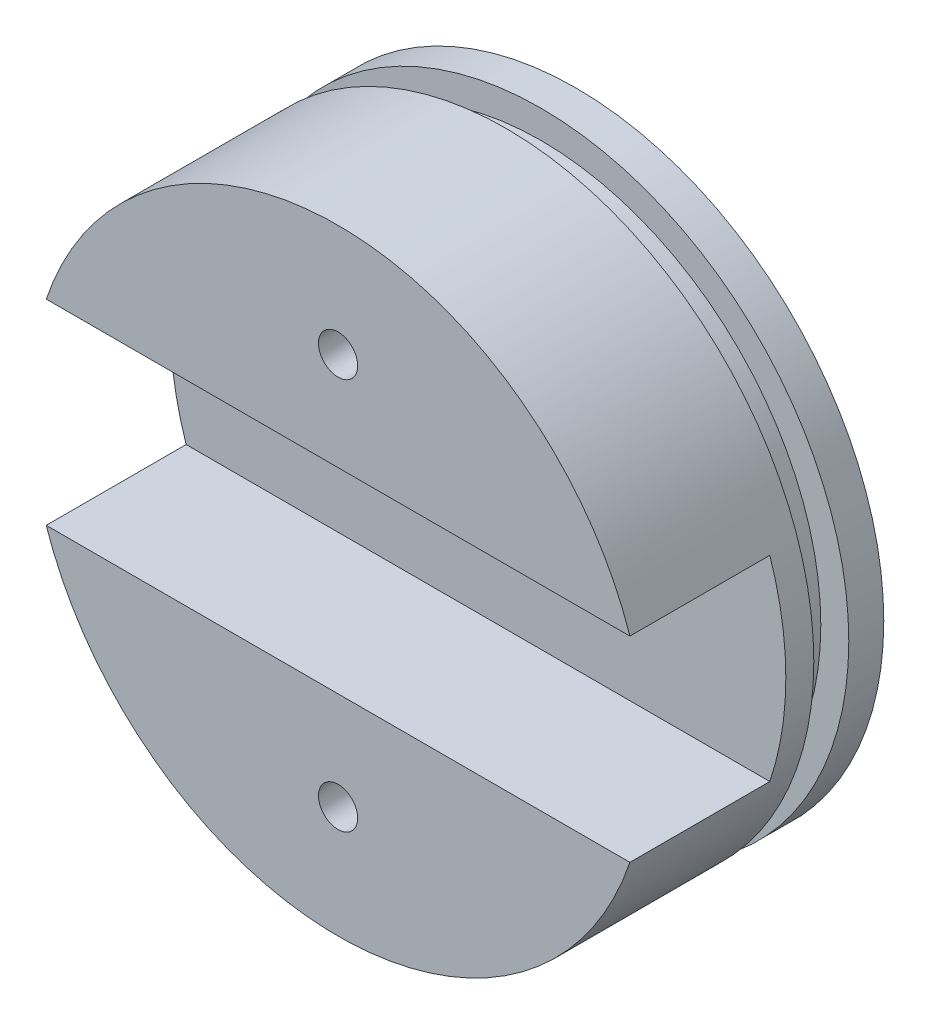
ISO-10303-21;
HEADER;
FILE_DESCRIPTION(('STEP AP214'),'2;1');
FILE_NAME('part.step','',(''),(''),'','','');
FILE_SCHEMA(('AUTOMOTIVE_DESIGN { 1 0 10303 214 1 1 1 1 }'));
ENDSEC;
DATA;
#1=APPLICATION_CONTEXT('core data for automotive mechanical design processes');
#2=APPLICATION_PROTOCOL_DEFINITION('international standard','automotive_design',2000,#1);
#3=PRODUCT_CONTEXT('',#1,'mechanical');
#4=PRODUCT('Part','Part','',(#3));
#5=PRODUCT_RELATED_PRODUCT_CATEGORY('part','',(#4));
#6=PRODUCT_DEFINITION_FORMATION('','',#4);
#7=PRODUCT_DEFINITION_CONTEXT('part definition',#1,'design');
#8=PRODUCT_DEFINITION('design','',#6,#7);
#9=PRODUCT_DEFINITION_SHAPE('','',#8);
#10=(LENGTH_UNIT() NAMED_UNIT(*) SI_UNIT(.MILLI.,.METRE.));
#11=(NAMED_UNIT(*) PLANE_ANGLE_UNIT() SI_UNIT($,.RADIAN.));
#12=(NAMED_UNIT(*) SI_UNIT($,.STERADIAN.) SOLID_ANGLE_UNIT());
#13=UNCERTAINTY_MEASURE_WITH_UNIT(LENGTH_MEASURE(1.E-05),#10,'distance_accuracy_value','');
#14=(GEOMETRIC_REPRESENTATION_CONTEXT(3) GLOBAL_UNCERTAINTY_ASSIGNED_CONTEXT((#13)) GLOBAL_UNIT_ASSIGNED_CONTEXT((#10,
#11,#12)) REPRESENTATION_CONTEXT('',''));
#15=CARTESIAN_POINT('',(0.,0.,0.));
#16=DIRECTION('',(0.,0.,1.));
#17=DIRECTION('',(1.,0.,0.));
#18=AXIS2_PLACEMENT_3D('',#15,#16,#17);
#19=CARTESIAN_POINT('',(0.,0.,17.));
#20=DIRECTION('',(0.,0.,-1.));
#21=DIRECTION('',(-1.,0.,0.));
#22=AXIS2_PLACEMENT_3D('',#19,#20,#21);
#23=CYLINDRICAL_SURFACE('',#22,22.);
#24=CARTESIAN_POINT('',(0.,0.,5.));
#25=DIRECTION('',(0.,0.,1.));
#26=DIRECTION('',(1.,0.,0.));
#27=AXIS2_PLACEMENT_3D('',#24,#25,#26);
#28=CIRCLE('',#27,22.);
#29=CARTESIAN_POINT('',(22.,0.,5.));
#30=VERTEX_POINT('',#29);
#31=EDGE_CURVE('E104',#30,#30,#28,.T.);
#32=ORIENTED_EDGE('',*,*,#31,.T.);
#33=EDGE_LOOP('',(#32));
#34=FACE_BOUND('',#33,.T.);
#35=DIRECTION('',(0.,0.,-1.));
#36=VECTOR('',#35,1.);
#37=CARTESIAN_POINT('',(20.8566536146142,-7.,17.));
#38=LINE('',#37,#36);
#39=CARTESIAN_POINT('',(20.8566536146142,-7.,17.));
#40=VERTEX_POINT('',#39);
#41=CARTESIAN_POINT('',(20.8566536146142,-7.,7.));
#42=VERTEX_POINT('',#41);
#43=EDGE_CURVE('E107',#40,#42,#38,.T.);
#44=ORIENTED_EDGE('',*,*,#43,.F.);
#45=CARTESIAN_POINT('',(0.,0.,17.));
#46=DIRECTION('',(0.,0.,1.));
#47=DIRECTION('',(1.,0.,0.));
#48=AXIS2_PLACEMENT_3D('',#45,#46,#47);
#49=CIRCLE('',#48,22.);
#50=CARTESIAN_POINT('',(-20.8566536146142,-7.,17.));
#51=VERTEX_POINT('',#50);
#52=EDGE_CURVE('E98',#51,#40,#49,.T.);
#53=ORIENTED_EDGE('',*,*,#52,.F.);
#54=DIRECTION('',(0.,0.,-1.));
#55=VECTOR('',#54,1.);
#56=CARTESIAN_POINT('',(-20.8566536146142,-7.,17.));
#57=LINE('',#56,#55);
#58=CARTESIAN_POINT('',(-20.8566536146142,-7.,7.));
#59=VERTEX_POINT('',#58);
#60=EDGE_CURVE('E94',#59,#51,#57,.F.);
#61=ORIENTED_EDGE('',*,*,#60,.F.);
#62=CARTESIAN_POINT('',(0.,0.,7.));
#63=DIRECTION('',(0.,0.,-1.));
#64=DIRECTION('',(-1.,0.,0.));
#65=AXIS2_PLACEMENT_3D('',#62,#63,#64);
#66=CIRCLE('',#65,22.);
#67=CARTESIAN_POINT('',(-20.8566536146142,7.,7.));
#68=VERTEX_POINT('',#67);
#69=EDGE_CURVE('E47',#59,#68,#66,.T.);
#70=ORIENTED_EDGE('',*,*,#69,.T.);
#71=DIRECTION('',(0.,0.,-1.));
#72=VECTOR('',#71,1.);
#73=CARTESIAN_POINT('',(-20.8566536146142,7.,17.));
#74=LINE('',#73,#72);
#75=CARTESIAN_POINT('',(-20.8566536146142,7.,17.));
#76=VERTEX_POINT('',#75);
#77=EDGE_CURVE('E83',#76,#68,#74,.T.);
#78=ORIENTED_EDGE('',*,*,#77,.F.);
#79=CARTESIAN_POINT('',(20.8566536146142,7.,17.));
#80=VERTEX_POINT('',#79);
#81=EDGE_CURVE('E92',#80,#76,#49,.T.);
#82=ORIENTED_EDGE('',*,*,#81,.F.);
#83=DIRECTION('',(0.,0.,-1.));
#84=VECTOR('',#83,1.);
#85=CARTESIAN_POINT('',(20.8566536146142,7.,17.));
#86=LINE('',#85,#84);
#87=CARTESIAN_POINT('',(20.8566536146142,7.,7.));
#88=VERTEX_POINT('',#87);
#89=EDGE_CURVE('E55',#88,#80,#86,.F.);
#90=ORIENTED_EDGE('',*,*,#89,.F.);
#91=EDGE_CURVE('E11',#88,#42,#66,.T.);
#92=ORIENTED_EDGE('',*,*,#91,.T.);
#93=EDGE_LOOP('',(#44,#53,#61,#70,#78,#82,#90,#92));
#94=FACE_BOUND('',#93,.T.);
#95=ADVANCED_FACE('F38',(#34,#94),#23,.T.);
#96=CARTESIAN_POINT('',(0.,0.,17.));
#97=DIRECTION('',(0.,0.,1.));
#98=DIRECTION('',(1.,0.,0.));
#99=AXIS2_PLACEMENT_3D('',#96,#97,#98);
#100=PLANE('',#99);
#101=CARTESIAN_POINT('',(0.,-14.,17.));
#102=DIRECTION('',(0.,0.,1.));
#103=DIRECTION('',(-1.,0.,0.));
#104=AXIS2_PLACEMENT_3D('',#101,#102,#103);
#105=CIRCLE('',#104,1.4);
#106=CARTESIAN_POINT('',(-1.4,-14.,17.));
#107=VERTEX_POINT('',#106);
#108=EDGE_CURVE('E125',#107,#107,#105,.T.);
#109=ORIENTED_EDGE('',*,*,#108,.F.);
#110=EDGE_LOOP('',(#109));
#111=FACE_BOUND('',#110,.T.);
#112=ORIENTED_EDGE('',*,*,#52,.T.);
#113=DIRECTION('',(-1.,0.,0.));
#114=VECTOR('',#113,1.);
#115=CARTESIAN_POINT('',(0.,-7.,17.));
#116=LINE('',#115,#114);
#117=EDGE_CURVE('E87',#40,#51,#116,.T.);
#118=ORIENTED_EDGE('',*,*,#117,.T.);
#119=EDGE_LOOP('',(#112,#118));
#120=FACE_BOUND('',#119,.T.);
#121=ADVANCED_FACE('F167',(#111,#120),#100,.T.);
#122=CARTESIAN_POINT('',(0.,14.,17.));
#123=DIRECTION('',(0.,0.,1.));
#124=DIRECTION('',(1.,0.,0.));
#125=AXIS2_PLACEMENT_3D('',#122,#123,#124);
#126=CIRCLE('',#125,1.4);
#127=CARTESIAN_POINT('',(1.4,14.,17.));
#128=VERTEX_POINT('',#127);
#129=EDGE_CURVE('E140',#128,#128,#126,.T.);
#130=ORIENTED_EDGE('',*,*,#129,.F.);
#131=EDGE_LOOP('',(#130));
#132=FACE_BOUND('',#131,.T.);
#133=ORIENTED_EDGE('',*,*,#81,.T.);
#134=DIRECTION('',(1.,0.,0.));
#135=VECTOR('',#134,1.);
#136=CARTESIAN_POINT('',(0.,7.,17.));
#137=LINE('',#136,#135);
#138=EDGE_CURVE('E80',#76,#80,#137,.T.);
#139=ORIENTED_EDGE('',*,*,#138,.T.);
#140=EDGE_LOOP('',(#133,#139));
#141=FACE_BOUND('',#140,.T.);
#142=ADVANCED_FACE('F96',(#132,#141),#100,.T.);
#143=CARTESIAN_POINT('',(0.,0.,2.5));
#144=DIRECTION('',(0.,0.,-1.));
#145=DIRECTION('',(-1.,0.,0.));
#146=AXIS2_PLACEMENT_3D('',#143,#144,#145);
#147=CYLINDRICAL_SURFACE('',#146,22.);
#148=CARTESIAN_POINT('',(0.,0.,2.5));
#149=DIRECTION('',(0.,0.,1.));
#150=DIRECTION('',(1.,0.,0.));
#151=AXIS2_PLACEMENT_3D('',#148,#149,#150);
#152=CIRCLE('',#151,22.);
#153=CARTESIAN_POINT('',(22.,0.,2.5));
#154=VERTEX_POINT('',#153);
#155=EDGE_CURVE('E88',#154,#154,#152,.T.);
#156=ORIENTED_EDGE('',*,*,#155,.F.);
#157=EDGE_LOOP('',(#156));
#158=FACE_BOUND('',#157,.T.);
#159=CARTESIAN_POINT('',(0.,0.,0.));
#160=DIRECTION('',(0.,0.,1.));
#161=DIRECTION('',(1.,0.,0.));
#162=AXIS2_PLACEMENT_3D('',#159,#160,#161);
#163=CIRCLE('',#162,22.);
#164=CARTESIAN_POINT('',(22.,0.,0.));
#165=VERTEX_POINT('',#164);
#166=EDGE_CURVE('E113',#165,#165,#163,.T.);
#167=ORIENTED_EDGE('',*,*,#166,.T.);
#168=EDGE_LOOP('',(#167));
#169=FACE_BOUND('',#168,.T.);
#170=ADVANCED_FACE('F40',(#158,#169),#147,.T.);
#171=CARTESIAN_POINT('',(0.,0.,2.5));
#172=DIRECTION('',(0.,0.,1.));
#173=DIRECTION('',(1.,0.,0.));
#174=AXIS2_PLACEMENT_3D('',#171,#172,#173);
#175=PLANE('',#174);
#176=CARTESIAN_POINT('',(0.,0.,2.5));
#177=DIRECTION('',(0.,0.,1.));
#178=DIRECTION('',(1.,0.,0.));
#179=AXIS2_PLACEMENT_3D('',#176,#177,#178);
#180=CIRCLE('',#179,20.);
#181=CARTESIAN_POINT('',(20.,0.,2.5));
#182=VERTEX_POINT('',#181);
#183=EDGE_CURVE('E101',#182,#182,#180,.F.);
#184=ORIENTED_EDGE('',*,*,#183,.T.);
#185=EDGE_LOOP('',(#184));
#186=FACE_BOUND('',#185,.T.);
#187=ORIENTED_EDGE('',*,*,#155,.T.);
#188=EDGE_LOOP('',(#187));
#189=FACE_BOUND('',#188,.T.);
#190=ADVANCED_FACE('F181',(#186,#189),#175,.T.);
#191=CARTESIAN_POINT('',(0.,0.,0.));
#192=DIRECTION('',(0.,0.,1.));
#193=DIRECTION('',(1.,0.,0.));
#194=AXIS2_PLACEMENT_3D('',#191,#192,#193);
#195=PLANE('',#194);
#196=CARTESIAN_POINT('',(0.,14.,0.));
#197=DIRECTION('',(0.,0.,1.));
#198=DIRECTION('',(1.,0.,0.));
#199=AXIS2_PLACEMENT_3D('',#196,#197,#198);
#200=CIRCLE('',#199,3.);
#201=CARTESIAN_POINT('',(3.,14.,0.));
#202=VERTEX_POINT('',#201);
#203=EDGE_CURVE('E127',#202,#202,#200,.T.);
#204=ORIENTED_EDGE('',*,*,#203,.T.);
#205=EDGE_LOOP('',(#204));
#206=FACE_BOUND('',#205,.T.);
#207=CARTESIAN_POINT('',(0.,-14.,0.));
#208=DIRECTION('',(0.,0.,1.));
#209=DIRECTION('',(1.,0.,0.));
#210=AXIS2_PLACEMENT_3D('',#207,#208,#209);
#211=CIRCLE('',#210,3.);
#212=CARTESIAN_POINT('',(3.,-14.,0.));
#213=VERTEX_POINT('',#212);
#214=EDGE_CURVE('E137',#213,#213,#211,.T.);
#215=ORIENTED_EDGE('',*,*,#214,.T.);
#216=EDGE_LOOP('',(#215));
#217=FACE_BOUND('',#216,.T.);
#218=ORIENTED_EDGE('',*,*,#166,.F.);
#219=EDGE_LOOP('',(#218));
#220=FACE_BOUND('',#219,.T.);
#221=ADVANCED_FACE('F179',(#206,#217,#220),#195,.F.);
#222=CARTESIAN_POINT('',(0.,0.,5.));
#223=DIRECTION('',(0.,0.,-1.));
#224=DIRECTION('',(-1.,0.,0.));
#225=AXIS2_PLACEMENT_3D('',#222,#223,#224);
#226=CYLINDRICAL_SURFACE('',#225,20.);
#227=ORIENTED_EDGE('',*,*,#183,.F.);
#228=EDGE_LOOP('',(#227));
#229=FACE_BOUND('',#228,.T.);
#230=CARTESIAN_POINT('',(0.,0.,5.));
#231=DIRECTION('',(0.,0.,1.));
#232=DIRECTION('',(1.,0.,0.));
#233=AXIS2_PLACEMENT_3D('',#230,#231,#232);
#234=CIRCLE('',#233,20.);
#235=CARTESIAN_POINT('',(20.,0.,5.));
#236=VERTEX_POINT('',#235);
#237=EDGE_CURVE('E97',#236,#236,#234,.T.);
#238=ORIENTED_EDGE('',*,*,#237,.F.);
#239=EDGE_LOOP('',(#238));
#240=FACE_BOUND('',#239,.T.);
#241=ADVANCED_FACE('F161',(#229,#240),#226,.T.);
#242=CARTESIAN_POINT('',(0.,0.,5.));
#243=DIRECTION('',(0.,0.,1.));
#244=DIRECTION('',(1.,0.,0.));
#245=AXIS2_PLACEMENT_3D('',#242,#243,#244);
#246=PLANE('',#245);
#247=ORIENTED_EDGE('',*,*,#237,.T.);
#248=EDGE_LOOP('',(#247));
#249=FACE_BOUND('',#248,.T.);
#250=ORIENTED_EDGE('',*,*,#31,.F.);
#251=EDGE_LOOP('',(#250));
#252=FACE_BOUND('',#251,.T.);
#253=ADVANCED_FACE('F154',(#249,#252),#246,.F.);
#254=CARTESIAN_POINT('',(0.,0.,7.));
#255=DIRECTION('',(0.,0.,-1.));
#256=DIRECTION('',(-1.,0.,0.));
#257=AXIS2_PLACEMENT_3D('',#254,#255,#256);
#258=PLANE('',#257);
#259=DIRECTION('',(1.,0.,0.));
#260=VECTOR('',#259,1.);
#261=CARTESIAN_POINT('',(0.,7.,7.));
#262=LINE('',#261,#260);
#263=EDGE_CURVE('E147',#68,#88,#262,.T.);
#264=ORIENTED_EDGE('',*,*,#263,.F.);
#265=ORIENTED_EDGE('',*,*,#69,.F.);
#266=DIRECTION('',(-1.,0.,0.));
#267=VECTOR('',#266,1.);
#268=CARTESIAN_POINT('',(0.,-7.,7.));
#269=LINE('',#268,#267);
#270=EDGE_CURVE('E143',#42,#59,#269,.T.);
#271=ORIENTED_EDGE('',*,*,#270,.F.);
#272=ORIENTED_EDGE('',*,*,#91,.F.);
#273=EDGE_LOOP('',(#264,#265,#271,#272));
#274=FACE_BOUND('',#273,.T.);
#275=ADVANCED_FACE('F152',(#274),#258,.F.);
#276=CARTESIAN_POINT('',(0.,-7.,7.));
#277=DIRECTION('',(0.,1.,0.));
#278=DIRECTION('',(0.,0.,1.));
#279=AXIS2_PLACEMENT_3D('',#276,#277,#278);
#280=PLANE('',#279);
#281=ORIENTED_EDGE('',*,*,#43,.T.);
#282=ORIENTED_EDGE('',*,*,#270,.T.);
#283=ORIENTED_EDGE('',*,*,#60,.T.);
#284=ORIENTED_EDGE('',*,*,#117,.F.);
#285=EDGE_LOOP('',(#281,#282,#283,#284));
#286=FACE_BOUND('',#285,.T.);
#287=ADVANCED_FACE('F150',(#286),#280,.T.);
#288=CARTESIAN_POINT('',(0.,7.,7.));
#289=DIRECTION('',(0.,-1.,0.));
#290=DIRECTION('',(0.,0.,-1.));
#291=AXIS2_PLACEMENT_3D('',#288,#289,#290);
#292=PLANE('',#291);
#293=ORIENTED_EDGE('',*,*,#77,.T.);
#294=ORIENTED_EDGE('',*,*,#263,.T.);
#295=ORIENTED_EDGE('',*,*,#89,.T.);
#296=ORIENTED_EDGE('',*,*,#138,.F.);
#297=EDGE_LOOP('',(#293,#294,#295,#296));
#298=FACE_BOUND('',#297,.T.);
#299=ADVANCED_FACE('F82',(#298),#292,.T.);
#300=CARTESIAN_POINT('',(0.,-14.,17.));
#301=DIRECTION('',(0.,0.,-1.));
#302=DIRECTION('',(-1.,0.,0.));
#303=AXIS2_PLACEMENT_3D('',#300,#301,#302);
#304=CYLINDRICAL_SURFACE('',#303,1.4);
#305=CARTESIAN_POINT('',(0.,-14.,1.3));
#306=DIRECTION('',(0.,0.,1.));
#307=DIRECTION('',(1.,0.,0.));
#308=AXIS2_PLACEMENT_3D('',#305,#306,#307);
#309=CIRCLE('',#308,1.4);
#310=CARTESIAN_POINT('',(1.4,-14.,1.3));
#311=VERTEX_POINT('',#310);
#312=EDGE_CURVE('E42',#311,#311,#309,.T.);
#313=ORIENTED_EDGE('',*,*,#312,.F.);
#314=EDGE_LOOP('',(#313));
#315=FACE_BOUND('',#314,.T.);
#316=ORIENTED_EDGE('',*,*,#108,.T.);
#317=EDGE_LOOP('',(#316));
#318=FACE_BOUND('',#317,.T.);
#319=ADVANCED_FACE('F207',(#315,#318),#304,.F.);
#320=CARTESIAN_POINT('',(0.,14.,17.));
#321=DIRECTION('',(0.,0.,-1.));
#322=DIRECTION('',(-1.,0.,0.));
#323=AXIS2_PLACEMENT_3D('',#320,#321,#322);
#324=CYLINDRICAL_SURFACE('',#323,1.4);
#325=CARTESIAN_POINT('',(0.,14.,1.3));
#326=DIRECTION('',(0.,0.,1.));
#327=DIRECTION('',(1.,0.,0.));
#328=AXIS2_PLACEMENT_3D('',#325,#326,#327);
#329=CIRCLE('',#328,1.4);
#330=CARTESIAN_POINT('',(1.4,14.,1.3));
#331=VERTEX_POINT('',#330);
#332=EDGE_CURVE('E119',#331,#331,#329,.T.);
#333=ORIENTED_EDGE('',*,*,#332,.F.);
#334=EDGE_LOOP('',(#333));
#335=FACE_BOUND('',#334,.T.);
#336=ORIENTED_EDGE('',*,*,#129,.T.);
#337=EDGE_LOOP('',(#336));
#338=FACE_BOUND('',#337,.T.);
#339=ADVANCED_FACE('F211',(#335,#338),#324,.F.);
#340=CARTESIAN_POINT('',(0.,14.,1.3));
#341=DIRECTION('',(0.,0.,-1.));
#342=DIRECTION('',(-1.,0.,0.));
#343=AXIS2_PLACEMENT_3D('',#340,#341,#342);
#344=CYLINDRICAL_SURFACE('',#343,3.);
#345=CARTESIAN_POINT('',(0.,14.,1.3));
#346=DIRECTION('',(0.,0.,1.));
#347=DIRECTION('',(1.,0.,0.));
#348=AXIS2_PLACEMENT_3D('',#345,#346,#347);
#349=CIRCLE('',#348,3.);
#350=CARTESIAN_POINT('',(3.,14.,1.3));
#351=VERTEX_POINT('',#350);
#352=EDGE_CURVE('E121',#351,#351,#349,.T.);
#353=ORIENTED_EDGE('',*,*,#352,.T.);
#354=EDGE_LOOP('',(#353));
#355=FACE_BOUND('',#354,.T.);
#356=ORIENTED_EDGE('',*,*,#203,.F.);
#357=EDGE_LOOP('',(#356));
#358=FACE_BOUND('',#357,.T.);
#359=ADVANCED_FACE('F215',(#355,#358),#344,.F.);
#360=CARTESIAN_POINT('',(0.,14.,1.3));
#361=DIRECTION('',(0.,0.,1.));
#362=DIRECTION('',(1.,0.,0.));
#363=AXIS2_PLACEMENT_3D('',#360,#361,#362);
#364=PLANE('',#363);
#365=ORIENTED_EDGE('',*,*,#332,.T.);
#366=EDGE_LOOP('',(#365));
#367=FACE_BOUND('',#366,.T.);
#368=ORIENTED_EDGE('',*,*,#352,.F.);
#369=EDGE_LOOP('',(#368));
#370=FACE_BOUND('',#369,.T.);
#371=ADVANCED_FACE('F225',(#367,#370),#364,.F.);
#372=CARTESIAN_POINT('',(0.,-14.,1.3));
#373=DIRECTION('',(0.,0.,-1.));
#374=DIRECTION('',(-1.,0.,0.));
#375=AXIS2_PLACEMENT_3D('',#372,#373,#374);
#376=CYLINDRICAL_SURFACE('',#375,3.);
#377=CARTESIAN_POINT('',(0.,-14.,1.3));
#378=DIRECTION('',(0.,0.,1.));
#379=DIRECTION('',(1.,0.,0.));
#380=AXIS2_PLACEMENT_3D('',#377,#378,#379);
#381=CIRCLE('',#380,3.);
#382=CARTESIAN_POINT('',(3.,-14.,1.3));
#383=VERTEX_POINT('',#382);
#384=EDGE_CURVE('E132',#383,#383,#381,.T.);
#385=ORIENTED_EDGE('',*,*,#384,.T.);
#386=EDGE_LOOP('',(#385));
#387=FACE_BOUND('',#386,.T.);
#388=ORIENTED_EDGE('',*,*,#214,.F.);
#389=EDGE_LOOP('',(#388));
#390=FACE_BOUND('',#389,.T.);
#391=ADVANCED_FACE('F221',(#387,#390),#376,.F.);
#392=CARTESIAN_POINT('',(0.,-14.,1.3));
#393=DIRECTION('',(0.,0.,1.));
#394=DIRECTION('',(1.,0.,0.));
#395=AXIS2_PLACEMENT_3D('',#392,#393,#394);
#396=PLANE('',#395);
#397=ORIENTED_EDGE('',*,*,#312,.T.);
#398=EDGE_LOOP('',(#397));
#399=FACE_BOUND('',#398,.T.);
#400=ORIENTED_EDGE('',*,*,#384,.F.);
#401=EDGE_LOOP('',(#400));
#402=FACE_BOUND('',#401,.T.);
#403=ADVANCED_FACE('F224',(#399,#402),#396,.F.);
#404=CLOSED_SHELL('',(#95,#121,#142,#170,#190,#221,#241,#253,#275,#287,#299,#319,#339,#359,#371,
#391,#403));
#405=MANIFOLD_SOLID_BREP('B2',#404);
#406=ADVANCED_BREP_SHAPE_REPRESENTATION('',(#18,#405),#14);
#407=SHAPE_DEFINITION_REPRESENTATION(#9,#406);
ENDSEC;
END-ISO-10303-21;
